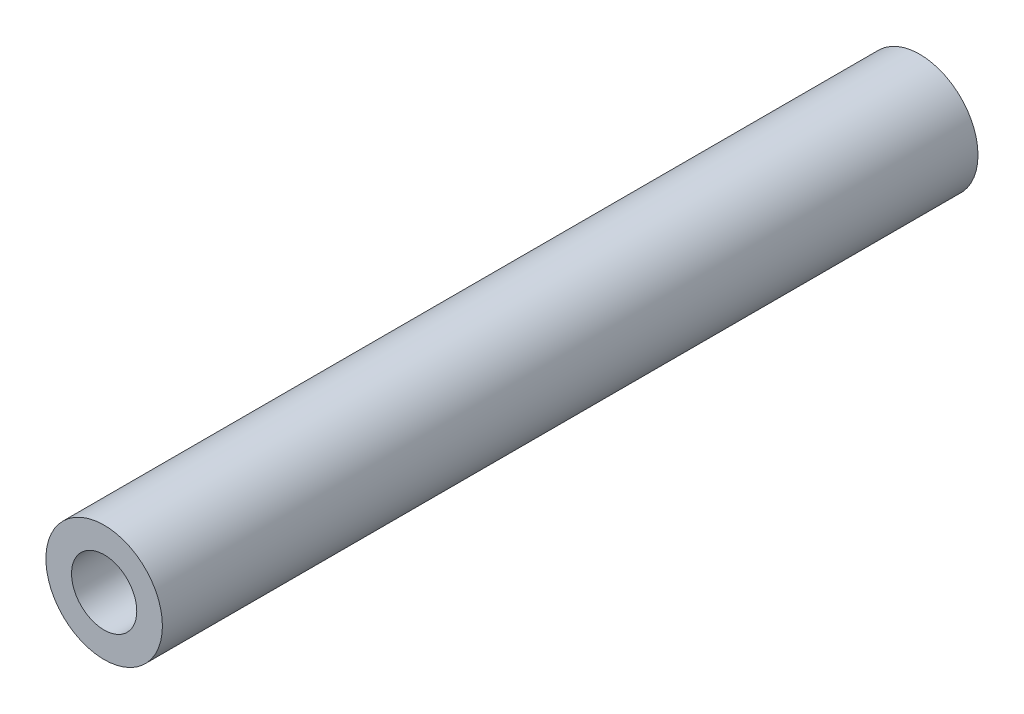
ISO-10303-21;
HEADER;
FILE_DESCRIPTION(('STEP AP214'),'2;1');
FILE_NAME('part.step','',(''),(''),'','','');
FILE_SCHEMA(('AUTOMOTIVE_DESIGN { 1 0 10303 214 1 1 1 1 }'));
ENDSEC;
DATA;
#1=APPLICATION_CONTEXT('core data for automotive mechanical design processes');
#2=APPLICATION_PROTOCOL_DEFINITION('international standard','automotive_design',2000,#1);
#3=PRODUCT_CONTEXT('',#1,'mechanical');
#4=PRODUCT('Part','Part','',(#3));
#5=PRODUCT_RELATED_PRODUCT_CATEGORY('part','',(#4));
#6=PRODUCT_DEFINITION_FORMATION('','',#4);
#7=PRODUCT_DEFINITION_CONTEXT('part definition',#1,'design');
#8=PRODUCT_DEFINITION('design','',#6,#7);
#9=PRODUCT_DEFINITION_SHAPE('','',#8);
#10=(LENGTH_UNIT() NAMED_UNIT(*) SI_UNIT(.MILLI.,.METRE.));
#11=(NAMED_UNIT(*) PLANE_ANGLE_UNIT() SI_UNIT($,.RADIAN.));
#12=(NAMED_UNIT(*) SI_UNIT($,.STERADIAN.) SOLID_ANGLE_UNIT());
#13=UNCERTAINTY_MEASURE_WITH_UNIT(LENGTH_MEASURE(1.E-05),#10,'distance_accuracy_value','');
#14=(GEOMETRIC_REPRESENTATION_CONTEXT(3) GLOBAL_UNCERTAINTY_ASSIGNED_CONTEXT((#13)) GLOBAL_UNIT_ASSIGNED_CONTEXT((#10,
#11,#12)) REPRESENTATION_CONTEXT('',''));
#15=CARTESIAN_POINT('',(0.,0.,0.));
#16=DIRECTION('',(0.,0.,1.));
#17=DIRECTION('',(1.,0.,0.));
#18=AXIS2_PLACEMENT_3D('',#15,#16,#17);
#19=CARTESIAN_POINT('',(0.,0.,44.45));
#20=DIRECTION('',(0.,0.,1.));
#21=DIRECTION('',(1.,0.,0.));
#22=AXIS2_PLACEMENT_3D('',#19,#20,#21);
#23=PLANE('',#22);
#24=CARTESIAN_POINT('',(0.,0.,44.45));
#25=DIRECTION('',(0.,0.,1.));
#26=DIRECTION('',(1.,0.,0.));
#27=AXIS2_PLACEMENT_3D('',#24,#25,#26);
#28=CIRCLE('',#27,3.175);
#29=CARTESIAN_POINT('',(3.175,0.,44.45));
#30=VERTEX_POINT('',#29);
#31=EDGE_CURVE('E10',#30,#30,#28,.T.);
#32=ORIENTED_EDGE('',*,*,#31,.T.);
#33=EDGE_LOOP('',(#32));
#34=FACE_BOUND('',#33,.T.);
#35=CARTESIAN_POINT('',(0.,0.,44.45));
#36=DIRECTION('',(0.,0.,1.));
#37=DIRECTION('',(1.,0.,0.));
#38=AXIS2_PLACEMENT_3D('',#35,#36,#37);
#39=CIRCLE('',#38,1.778);
#40=CARTESIAN_POINT('',(1.778,0.,44.45));
#41=VERTEX_POINT('',#40);
#42=EDGE_CURVE('E42',#41,#41,#39,.T.);
#43=ORIENTED_EDGE('',*,*,#42,.F.);
#44=EDGE_LOOP('',(#43));
#45=FACE_BOUND('',#44,.T.);
#46=ADVANCED_FACE('F31',(#34,#45),#23,.T.);
#47=CARTESIAN_POINT('',(0.,0.,0.));
#48=DIRECTION('',(0.,0.,1.));
#49=DIRECTION('',(1.,0.,0.));
#50=AXIS2_PLACEMENT_3D('',#47,#48,#49);
#51=PLANE('',#50);
#52=CARTESIAN_POINT('',(0.,0.,0.));
#53=DIRECTION('',(0.,0.,1.));
#54=DIRECTION('',(1.,0.,0.));
#55=AXIS2_PLACEMENT_3D('',#52,#53,#54);
#56=CIRCLE('',#55,3.175);
#57=CARTESIAN_POINT('',(3.175,0.,0.));
#58=VERTEX_POINT('',#57);
#59=EDGE_CURVE('E35',#58,#58,#56,.T.);
#60=ORIENTED_EDGE('',*,*,#59,.F.);
#61=EDGE_LOOP('',(#60));
#62=FACE_BOUND('',#61,.T.);
#63=CARTESIAN_POINT('',(0.,0.,0.));
#64=DIRECTION('',(0.,0.,1.));
#65=DIRECTION('',(1.,0.,0.));
#66=AXIS2_PLACEMENT_3D('',#63,#64,#65);
#67=CIRCLE('',#66,1.778);
#68=CARTESIAN_POINT('',(1.778,0.,0.));
#69=VERTEX_POINT('',#68);
#70=EDGE_CURVE('E44',#69,#69,#67,.T.);
#71=ORIENTED_EDGE('',*,*,#70,.T.);
#72=EDGE_LOOP('',(#71));
#73=FACE_BOUND('',#72,.T.);
#74=ADVANCED_FACE('F54',(#62,#73),#51,.F.);
#75=CARTESIAN_POINT('',(0.,0.,44.45));
#76=DIRECTION('',(0.,0.,-1.));
#77=DIRECTION('',(-1.,0.,0.));
#78=AXIS2_PLACEMENT_3D('',#75,#76,#77);
#79=CYLINDRICAL_SURFACE('',#78,3.175);
#80=ORIENTED_EDGE('',*,*,#31,.F.);
#81=EDGE_LOOP('',(#80));
#82=FACE_BOUND('',#81,.T.);
#83=ORIENTED_EDGE('',*,*,#59,.T.);
#84=EDGE_LOOP('',(#83));
#85=FACE_BOUND('',#84,.T.);
#86=ADVANCED_FACE('F33',(#82,#85),#79,.T.);
#87=CARTESIAN_POINT('',(0.,0.,44.45));
#88=DIRECTION('',(0.,0.,-1.));
#89=DIRECTION('',(-1.,0.,0.));
#90=AXIS2_PLACEMENT_3D('',#87,#88,#89);
#91=CYLINDRICAL_SURFACE('',#90,1.778);
#92=ORIENTED_EDGE('',*,*,#42,.T.);
#93=EDGE_LOOP('',(#92));
#94=FACE_BOUND('',#93,.T.);
#95=ORIENTED_EDGE('',*,*,#70,.F.);
#96=EDGE_LOOP('',(#95));
#97=FACE_BOUND('',#96,.T.);
#98=ADVANCED_FACE('F50',(#94,#97),#91,.F.);
#99=CLOSED_SHELL('',(#46,#74,#86,#98));
#100=MANIFOLD_SOLID_BREP('B2',#99);
#101=ADVANCED_BREP_SHAPE_REPRESENTATION('',(#18,#100),#14);
#102=SHAPE_DEFINITION_REPRESENTATION(#9,#101);
ENDSEC;
END-ISO-10303-21;
